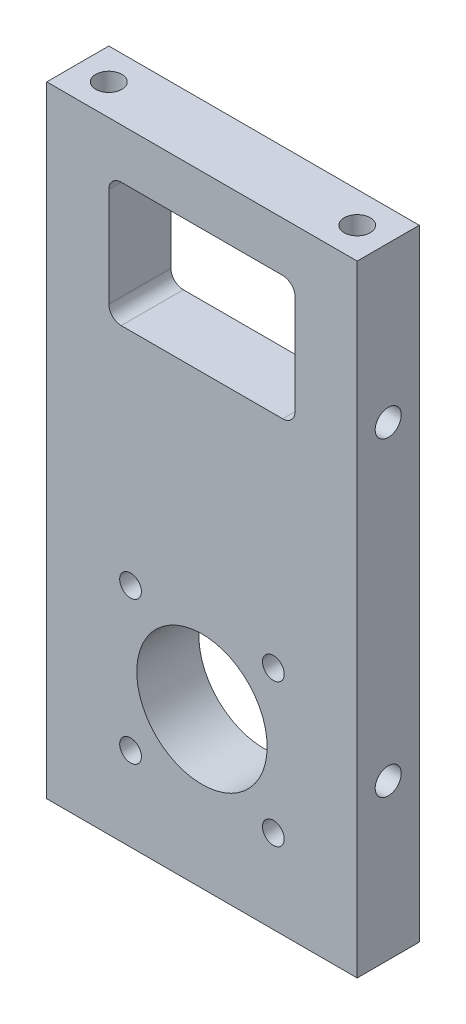
ISO-10303-21;
HEADER;
FILE_DESCRIPTION(('STEP AP214'),'2;1');
FILE_NAME('part.step','',(''),(''),'','','');
FILE_SCHEMA(('AUTOMOTIVE_DESIGN { 1 0 10303 214 1 1 1 1 }'));
ENDSEC;
DATA;
#1=APPLICATION_CONTEXT('core data for automotive mechanical design processes');
#2=APPLICATION_PROTOCOL_DEFINITION('international standard','automotive_design',2000,#1);
#3=PRODUCT_CONTEXT('',#1,'mechanical');
#4=PRODUCT('Part','Part','',(#3));
#5=PRODUCT_RELATED_PRODUCT_CATEGORY('part','',(#4));
#6=PRODUCT_DEFINITION_FORMATION('','',#4);
#7=PRODUCT_DEFINITION_CONTEXT('part definition',#1,'design');
#8=PRODUCT_DEFINITION('design','',#6,#7);
#9=PRODUCT_DEFINITION_SHAPE('','',#8);
#10=(LENGTH_UNIT() NAMED_UNIT(*) SI_UNIT(.MILLI.,.METRE.));
#11=(NAMED_UNIT(*) PLANE_ANGLE_UNIT() SI_UNIT($,.RADIAN.));
#12=(NAMED_UNIT(*) SI_UNIT($,.STERADIAN.) SOLID_ANGLE_UNIT());
#13=UNCERTAINTY_MEASURE_WITH_UNIT(LENGTH_MEASURE(1.E-05),#10,'distance_accuracy_value','');
#14=(GEOMETRIC_REPRESENTATION_CONTEXT(3) GLOBAL_UNCERTAINTY_ASSIGNED_CONTEXT((#13)) GLOBAL_UNIT_ASSIGNED_CONTEXT((#10,
#11,#12)) REPRESENTATION_CONTEXT('',''));
#15=CARTESIAN_POINT('',(0.,0.,0.));
#16=DIRECTION('',(0.,0.,1.));
#17=DIRECTION('',(1.,0.,0.));
#18=AXIS2_PLACEMENT_3D('',#15,#16,#17);
#19=CARTESIAN_POINT('',(-26.0517455341106,100.,394.692172038795));
#20=DIRECTION('',(1.,0.,0.));
#21=DIRECTION('',(0.,0.,-1.));
#22=AXIS2_PLACEMENT_3D('',#19,#20,#21);
#23=PLANE('',#22);
#24=CARTESIAN_POINT('',(-26.0517455341106,75.,389.692172038795));
#25=DIRECTION('',(-1.,0.,0.));
#26=DIRECTION('',(0.,0.,1.));
#27=AXIS2_PLACEMENT_3D('',#24,#25,#26);
#28=CIRCLE('',#27,2.09999999999999);
#29=CARTESIAN_POINT('',(-26.0517455341106,75.,391.792172038795));
#30=VERTEX_POINT('',#29);
#31=EDGE_CURVE('E171',#30,#30,#28,.T.);
#32=ORIENTED_EDGE('',*,*,#31,.F.);
#33=EDGE_LOOP('',(#32));
#34=FACE_BOUND('',#33,.T.);
#35=CARTESIAN_POINT('',(-26.0517455341106,25.,389.692172038795));
#36=DIRECTION('',(-1.,0.,0.));
#37=DIRECTION('',(0.,0.,1.));
#38=AXIS2_PLACEMENT_3D('',#35,#36,#37);
#39=CIRCLE('',#38,2.09999999999999);
#40=CARTESIAN_POINT('',(-26.0517455341106,25.,391.792172038795));
#41=VERTEX_POINT('',#40);
#42=EDGE_CURVE('E177',#41,#41,#39,.T.);
#43=ORIENTED_EDGE('',*,*,#42,.F.);
#44=EDGE_LOOP('',(#43));
#45=FACE_BOUND('',#44,.T.);
#46=DIRECTION('',(0.,0.,1.));
#47=VECTOR('',#46,1.);
#48=CARTESIAN_POINT('',(-26.0517455341106,0.,394.692172038795));
#49=LINE('',#48,#47);
#50=CARTESIAN_POINT('',(-26.0517455341106,0.,384.692172038795));
#51=VERTEX_POINT('',#50);
#52=CARTESIAN_POINT('',(-26.0517455341106,0.,394.692172038795));
#53=VERTEX_POINT('',#52);
#54=EDGE_CURVE('E207',#51,#53,#49,.T.);
#55=ORIENTED_EDGE('',*,*,#54,.T.);
#56=DIRECTION('',(0.,-1.,0.));
#57=VECTOR('',#56,1.);
#58=CARTESIAN_POINT('',(-26.0517455341106,100.,394.692172038795));
#59=LINE('',#58,#57);
#60=CARTESIAN_POINT('',(-26.0517455341106,100.,394.692172038795));
#61=VERTEX_POINT('',#60);
#62=EDGE_CURVE('E234',#61,#53,#59,.T.);
#63=ORIENTED_EDGE('',*,*,#62,.F.);
#64=DIRECTION('',(0.,0.,1.));
#65=VECTOR('',#64,1.);
#66=CARTESIAN_POINT('',(-26.0517455341106,100.,394.692172038795));
#67=LINE('',#66,#65);
#68=CARTESIAN_POINT('',(-26.0517455341106,100.,384.692172038795));
#69=VERTEX_POINT('',#68);
#70=EDGE_CURVE('E208',#69,#61,#67,.T.);
#71=ORIENTED_EDGE('',*,*,#70,.F.);
#72=DIRECTION('',(0.,-1.,0.));
#73=VECTOR('',#72,1.);
#74=CARTESIAN_POINT('',(-26.0517455341106,100.,384.692172038795));
#75=LINE('',#74,#73);
#76=EDGE_CURVE('E218',#69,#51,#75,.T.);
#77=ORIENTED_EDGE('',*,*,#76,.T.);
#78=EDGE_LOOP('',(#55,#63,#71,#77));
#79=FACE_BOUND('',#78,.T.);
#80=ADVANCED_FACE('F37',(#34,#45,#79),#23,.F.);
#81=CARTESIAN_POINT('',(-26.0517455341106,100.,394.692172038795));
#82=DIRECTION('',(0.,0.,-1.));
#83=DIRECTION('',(-1.,0.,0.));
#84=AXIS2_PLACEMENT_3D('',#81,#82,#83);
#85=PLANE('',#84);
#86=CARTESIAN_POINT('',(-12.5517455341106,13.5,394.692172038795));
#87=DIRECTION('',(0.,0.,1.));
#88=DIRECTION('',(1.,0.,0.));
#89=AXIS2_PLACEMENT_3D('',#86,#87,#88);
#90=CIRCLE('',#89,1.75);
#91=CARTESIAN_POINT('',(-10.8017455341106,13.5,394.692172038795));
#92=VERTEX_POINT('',#91);
#93=EDGE_CURVE('E730',#92,#92,#90,.T.);
#94=ORIENTED_EDGE('',*,*,#93,.F.);
#95=EDGE_LOOP('',(#94));
#96=FACE_BOUND('',#95,.T.);
#97=CARTESIAN_POINT('',(10.4482544658894,13.5,394.692172038795));
#98=DIRECTION('',(0.,0.,1.));
#99=DIRECTION('',(1.,0.,0.));
#100=AXIS2_PLACEMENT_3D('',#97,#98,#99);
#101=CIRCLE('',#100,1.75);
#102=CARTESIAN_POINT('',(12.1982544658894,13.5,394.692172038795));
#103=VERTEX_POINT('',#102);
#104=EDGE_CURVE('E724',#103,#103,#101,.T.);
#105=ORIENTED_EDGE('',*,*,#104,.F.);
#106=EDGE_LOOP('',(#105));
#107=FACE_BOUND('',#106,.T.);
#108=CARTESIAN_POINT('',(10.4482544658894,36.5,394.692172038795));
#109=DIRECTION('',(0.,0.,1.));
#110=DIRECTION('',(1.,0.,0.));
#111=AXIS2_PLACEMENT_3D('',#108,#109,#110);
#112=CIRCLE('',#111,1.75);
#113=CARTESIAN_POINT('',(12.1982544658894,36.5,394.692172038795));
#114=VERTEX_POINT('',#113);
#115=EDGE_CURVE('E718',#114,#114,#112,.T.);
#116=ORIENTED_EDGE('',*,*,#115,.F.);
#117=EDGE_LOOP('',(#116));
#118=FACE_BOUND('',#117,.T.);
#119=CARTESIAN_POINT('',(-12.5517455341106,36.5,394.692172038795));
#120=DIRECTION('',(0.,0.,1.));
#121=DIRECTION('',(1.,0.,0.));
#122=AXIS2_PLACEMENT_3D('',#119,#120,#121);
#123=CIRCLE('',#122,1.75);
#124=CARTESIAN_POINT('',(-10.8017455341106,36.5,394.692172038795));
#125=VERTEX_POINT('',#124);
#126=EDGE_CURVE('E710',#125,#125,#123,.T.);
#127=ORIENTED_EDGE('',*,*,#126,.F.);
#128=EDGE_LOOP('',(#127));
#129=FACE_BOUND('',#128,.T.);
#130=CARTESIAN_POINT('',(-1.05174553411058,25.,394.692172038795));
#131=DIRECTION('',(0.,0.,1.));
#132=DIRECTION('',(1.,0.,0.));
#133=AXIS2_PLACEMENT_3D('',#130,#131,#132);
#134=CIRCLE('',#133,10.5);
#135=CARTESIAN_POINT('',(9.44825446588942,25.,394.692172038795));
#136=VERTEX_POINT('',#135);
#137=EDGE_CURVE('E334',#136,#136,#134,.T.);
#138=ORIENTED_EDGE('',*,*,#137,.F.);
#139=EDGE_LOOP('',(#138));
#140=FACE_BOUND('',#139,.T.);
#141=DIRECTION('',(1.,0.,0.));
#142=VECTOR('',#141,1.);
#143=CARTESIAN_POINT('',(-16.0517455341106,72.,394.692172038795));
#144=LINE('',#143,#142);
#145=CARTESIAN_POINT('',(-14.0517455341106,72.,394.692172038795));
#146=VERTEX_POINT('',#145);
#147=CARTESIAN_POINT('',(11.9482544658894,72.,394.692172038795));
#148=VERTEX_POINT('',#147);
#149=EDGE_CURVE('E339',#146,#148,#144,.T.);
#150=ORIENTED_EDGE('',*,*,#149,.F.);
#151=CARTESIAN_POINT('',(-14.0517455341106,74.,394.692172038795));
#152=DIRECTION('',(0.,0.,-1.));
#153=DIRECTION('',(-1.,0.,0.));
#154=AXIS2_PLACEMENT_3D('',#151,#152,#153);
#155=CIRCLE('',#154,2.);
#156=CARTESIAN_POINT('',(-16.0517455341106,74.,394.692172038795));
#157=VERTEX_POINT('',#156);
#158=EDGE_CURVE('E45',#146,#157,#155,.T.);
#159=ORIENTED_EDGE('',*,*,#158,.T.);
#160=DIRECTION('',(0.,-1.,0.));
#161=VECTOR('',#160,1.);
#162=CARTESIAN_POINT('',(-16.0517455341106,92.,394.692172038795));
#163=LINE('',#162,#161);
#164=CARTESIAN_POINT('',(-16.0517455341106,90.,394.692172038795));
#165=VERTEX_POINT('',#164);
#166=EDGE_CURVE('E280',#165,#157,#163,.T.);
#167=ORIENTED_EDGE('',*,*,#166,.F.);
#168=CARTESIAN_POINT('',(-14.0517455341106,90.,394.692172038795));
#169=DIRECTION('',(0.,0.,-1.));
#170=DIRECTION('',(-1.,0.,0.));
#171=AXIS2_PLACEMENT_3D('',#168,#169,#170);
#172=CIRCLE('',#171,2.);
#173=CARTESIAN_POINT('',(-14.0517455341106,92.,394.692172038795));
#174=VERTEX_POINT('',#173);
#175=EDGE_CURVE('E59',#165,#174,#172,.T.);
#176=ORIENTED_EDGE('',*,*,#175,.T.);
#177=DIRECTION('',(-1.,0.,0.));
#178=VECTOR('',#177,1.);
#179=CARTESIAN_POINT('',(-16.0517455341106,92.,394.692172038795));
#180=LINE('',#179,#178);
#181=CARTESIAN_POINT('',(11.9482544658894,92.,394.692172038795));
#182=VERTEX_POINT('',#181);
#183=EDGE_CURVE('E344',#182,#174,#180,.T.);
#184=ORIENTED_EDGE('',*,*,#183,.F.);
#185=CARTESIAN_POINT('',(11.9482544658894,90.,394.692172038795));
#186=DIRECTION('',(0.,0.,-1.));
#187=DIRECTION('',(-1.,0.,0.));
#188=AXIS2_PLACEMENT_3D('',#185,#186,#187);
#189=CIRCLE('',#188,2.);
#190=CARTESIAN_POINT('',(13.9482544658894,90.,394.692172038795));
#191=VERTEX_POINT('',#190);
#192=EDGE_CURVE('E260',#182,#191,#189,.T.);
#193=ORIENTED_EDGE('',*,*,#192,.T.);
#194=DIRECTION('',(0.,1.,0.));
#195=VECTOR('',#194,1.);
#196=CARTESIAN_POINT('',(13.9482544658894,92.,394.692172038795));
#197=LINE('',#196,#195);
#198=CARTESIAN_POINT('',(13.9482544658894,74.,394.692172038795));
#199=VERTEX_POINT('',#198);
#200=EDGE_CURVE('E342',#199,#191,#197,.T.);
#201=ORIENTED_EDGE('',*,*,#200,.F.);
#202=CARTESIAN_POINT('',(11.9482544658894,74.,394.692172038795));
#203=DIRECTION('',(0.,0.,-1.));
#204=DIRECTION('',(-1.,0.,0.));
#205=AXIS2_PLACEMENT_3D('',#202,#203,#204);
#206=CIRCLE('',#205,2.);
#207=EDGE_CURVE('E256',#199,#148,#206,.T.);
#208=ORIENTED_EDGE('',*,*,#207,.T.);
#209=EDGE_LOOP('',(#150,#159,#167,#176,#184,#193,#201,#208));
#210=FACE_BOUND('',#209,.T.);
#211=DIRECTION('',(1.,0.,0.));
#212=VECTOR('',#211,1.);
#213=CARTESIAN_POINT('',(-26.0517455341106,0.,394.692172038795));
#214=LINE('',#213,#212);
#215=CARTESIAN_POINT('',(23.9482544658894,0.,394.692172038795));
#216=VERTEX_POINT('',#215);
#217=EDGE_CURVE('E221',#53,#216,#214,.T.);
#218=ORIENTED_EDGE('',*,*,#217,.T.);
#219=DIRECTION('',(0.,-1.,0.));
#220=VECTOR('',#219,1.);
#221=CARTESIAN_POINT('',(23.9482544658894,100.,394.692172038795));
#222=LINE('',#221,#220);
#223=CARTESIAN_POINT('',(23.9482544658894,100.,394.692172038795));
#224=VERTEX_POINT('',#223);
#225=EDGE_CURVE('E231',#224,#216,#222,.T.);
#226=ORIENTED_EDGE('',*,*,#225,.F.);
#227=DIRECTION('',(1.,0.,0.));
#228=VECTOR('',#227,1.);
#229=CARTESIAN_POINT('',(-26.0517455341106,100.,394.692172038795));
#230=LINE('',#229,#228);
#231=EDGE_CURVE('E211',#61,#224,#230,.T.);
#232=ORIENTED_EDGE('',*,*,#231,.F.);
#233=ORIENTED_EDGE('',*,*,#62,.T.);
#234=EDGE_LOOP('',(#218,#226,#232,#233));
#235=FACE_BOUND('',#234,.T.);
#236=ADVANCED_FACE('F294',(#96,#107,#118,#129,#140,#210,#235),#85,.F.);
#237=CARTESIAN_POINT('',(23.9482544658894,100.,394.692172038795));
#238=DIRECTION('',(-1.,0.,0.));
#239=DIRECTION('',(0.,0.,1.));
#240=AXIS2_PLACEMENT_3D('',#237,#238,#239);
#241=PLANE('',#240);
#242=CARTESIAN_POINT('',(23.9482544658894,75.,389.692172038795));
#243=DIRECTION('',(1.,0.,0.));
#244=DIRECTION('',(0.,0.,-1.));
#245=AXIS2_PLACEMENT_3D('',#242,#243,#244);
#246=CIRCLE('',#245,2.09999999999999);
#247=CARTESIAN_POINT('',(23.9482544658894,75.,387.592172038795));
#248=VERTEX_POINT('',#247);
#249=EDGE_CURVE('E159',#248,#248,#246,.T.);
#250=ORIENTED_EDGE('',*,*,#249,.F.);
#251=EDGE_LOOP('',(#250));
#252=FACE_BOUND('',#251,.T.);
#253=CARTESIAN_POINT('',(23.9482544658894,25.,389.692172038795));
#254=DIRECTION('',(1.,0.,0.));
#255=DIRECTION('',(0.,0.,-1.));
#256=AXIS2_PLACEMENT_3D('',#253,#254,#255);
#257=CIRCLE('',#256,2.09999999999999);
#258=CARTESIAN_POINT('',(23.9482544658894,25.,387.592172038795));
#259=VERTEX_POINT('',#258);
#260=EDGE_CURVE('E158',#259,#259,#257,.T.);
#261=ORIENTED_EDGE('',*,*,#260,.F.);
#262=EDGE_LOOP('',(#261));
#263=FACE_BOUND('',#262,.T.);
#264=DIRECTION('',(0.,0.,-1.));
#265=VECTOR('',#264,1.);
#266=CARTESIAN_POINT('',(23.9482544658894,0.,394.692172038795));
#267=LINE('',#266,#265);
#268=CARTESIAN_POINT('',(23.9482544658894,0.,384.692172038795));
#269=VERTEX_POINT('',#268);
#270=EDGE_CURVE('E223',#216,#269,#267,.T.);
#271=ORIENTED_EDGE('',*,*,#270,.T.);
#272=DIRECTION('',(0.,-1.,0.));
#273=VECTOR('',#272,1.);
#274=CARTESIAN_POINT('',(23.9482544658894,100.,384.692172038795));
#275=LINE('',#274,#273);
#276=CARTESIAN_POINT('',(23.9482544658894,100.,384.692172038795));
#277=VERTEX_POINT('',#276);
#278=EDGE_CURVE('E228',#277,#269,#275,.T.);
#279=ORIENTED_EDGE('',*,*,#278,.F.);
#280=DIRECTION('',(0.,0.,-1.));
#281=VECTOR('',#280,1.);
#282=CARTESIAN_POINT('',(23.9482544658894,100.,394.692172038795));
#283=LINE('',#282,#281);
#284=EDGE_CURVE('E214',#224,#277,#283,.T.);
#285=ORIENTED_EDGE('',*,*,#284,.F.);
#286=ORIENTED_EDGE('',*,*,#225,.T.);
#287=EDGE_LOOP('',(#271,#279,#285,#286));
#288=FACE_BOUND('',#287,.T.);
#289=ADVANCED_FACE('F300',(#252,#263,#288),#241,.F.);
#290=CARTESIAN_POINT('',(-26.0517455341106,100.,384.692172038795));
#291=DIRECTION('',(0.,0.,1.));
#292=DIRECTION('',(1.,0.,0.));
#293=AXIS2_PLACEMENT_3D('',#290,#291,#292);
#294=PLANE('',#293);
#295=CARTESIAN_POINT('',(-12.5517455341106,13.5,384.692172038795));
#296=DIRECTION('',(0.,0.,1.));
#297=DIRECTION('',(1.,0.,0.));
#298=AXIS2_PLACEMENT_3D('',#295,#296,#297);
#299=CIRCLE('',#298,1.75);
#300=CARTESIAN_POINT('',(-10.8017455341106,13.5,384.692172038795));
#301=VERTEX_POINT('',#300);
#302=EDGE_CURVE('E727',#301,#301,#299,.F.);
#303=ORIENTED_EDGE('',*,*,#302,.F.);
#304=EDGE_LOOP('',(#303));
#305=FACE_BOUND('',#304,.T.);
#306=CARTESIAN_POINT('',(10.4482544658894,13.5,384.692172038795));
#307=DIRECTION('',(0.,0.,1.));
#308=DIRECTION('',(1.,0.,0.));
#309=AXIS2_PLACEMENT_3D('',#306,#307,#308);
#310=CIRCLE('',#309,1.75);
#311=CARTESIAN_POINT('',(12.1982544658894,13.5,384.692172038795));
#312=VERTEX_POINT('',#311);
#313=EDGE_CURVE('E721',#312,#312,#310,.F.);
#314=ORIENTED_EDGE('',*,*,#313,.F.);
#315=EDGE_LOOP('',(#314));
#316=FACE_BOUND('',#315,.T.);
#317=CARTESIAN_POINT('',(10.4482544658894,36.5,384.692172038795));
#318=DIRECTION('',(0.,0.,1.));
#319=DIRECTION('',(1.,0.,0.));
#320=AXIS2_PLACEMENT_3D('',#317,#318,#319);
#321=CIRCLE('',#320,1.75);
#322=CARTESIAN_POINT('',(12.1982544658894,36.5,384.692172038795));
#323=VERTEX_POINT('',#322);
#324=EDGE_CURVE('E715',#323,#323,#321,.F.);
#325=ORIENTED_EDGE('',*,*,#324,.F.);
#326=EDGE_LOOP('',(#325));
#327=FACE_BOUND('',#326,.T.);
#328=CARTESIAN_POINT('',(-12.5517455341106,36.5,384.692172038795));
#329=DIRECTION('',(0.,0.,1.));
#330=DIRECTION('',(1.,0.,0.));
#331=AXIS2_PLACEMENT_3D('',#328,#329,#330);
#332=CIRCLE('',#331,1.75);
#333=CARTESIAN_POINT('',(-10.8017455341106,36.5,384.692172038795));
#334=VERTEX_POINT('',#333);
#335=EDGE_CURVE('E708',#334,#334,#332,.F.);
#336=ORIENTED_EDGE('',*,*,#335,.F.);
#337=EDGE_LOOP('',(#336));
#338=FACE_BOUND('',#337,.T.);
#339=CARTESIAN_POINT('',(-1.05174553411058,25.,384.692172038795));
#340=DIRECTION('',(0.,0.,1.));
#341=DIRECTION('',(1.,0.,0.));
#342=AXIS2_PLACEMENT_3D('',#339,#340,#341);
#343=CIRCLE('',#342,10.5);
#344=CARTESIAN_POINT('',(9.44825446588942,25.,384.692172038795));
#345=VERTEX_POINT('',#344);
#346=EDGE_CURVE('E330',#345,#345,#343,.F.);
#347=ORIENTED_EDGE('',*,*,#346,.F.);
#348=EDGE_LOOP('',(#347));
#349=FACE_BOUND('',#348,.T.);
#350=DIRECTION('',(1.,0.,0.));
#351=VECTOR('',#350,1.);
#352=CARTESIAN_POINT('',(-16.0517455341106,92.,384.692172038795));
#353=LINE('',#352,#351);
#354=CARTESIAN_POINT('',(-14.0517455341106,92.,384.692172038795));
#355=VERTEX_POINT('',#354);
#356=CARTESIAN_POINT('',(11.9482544658894,92.,384.692172038795));
#357=VERTEX_POINT('',#356);
#358=EDGE_CURVE('E276',#355,#357,#353,.T.);
#359=ORIENTED_EDGE('',*,*,#358,.F.);
#360=CARTESIAN_POINT('',(-14.0517455341106,90.,384.692172038795));
#361=DIRECTION('',(0.,0.,1.));
#362=DIRECTION('',(1.,0.,0.));
#363=AXIS2_PLACEMENT_3D('',#360,#361,#362);
#364=CIRCLE('',#363,2.);
#365=CARTESIAN_POINT('',(-16.0517455341106,90.,384.692172038795));
#366=VERTEX_POINT('',#365);
#367=EDGE_CURVE('E265',#355,#366,#364,.T.);
#368=ORIENTED_EDGE('',*,*,#367,.T.);
#369=DIRECTION('',(0.,1.,0.));
#370=VECTOR('',#369,1.);
#371=CARTESIAN_POINT('',(-16.0517455341106,92.,384.692172038795));
#372=LINE('',#371,#370);
#373=CARTESIAN_POINT('',(-16.0517455341106,74.,384.692172038795));
#374=VERTEX_POINT('',#373);
#375=EDGE_CURVE('E273',#374,#366,#372,.T.);
#376=ORIENTED_EDGE('',*,*,#375,.F.);
#377=CARTESIAN_POINT('',(-14.0517455341106,74.,384.692172038795));
#378=DIRECTION('',(0.,0.,1.));
#379=DIRECTION('',(1.,0.,0.));
#380=AXIS2_PLACEMENT_3D('',#377,#378,#379);
#381=CIRCLE('',#380,2.);
#382=CARTESIAN_POINT('',(-14.0517455341106,72.,384.692172038795));
#383=VERTEX_POINT('',#382);
#384=EDGE_CURVE('E11',#374,#383,#381,.T.);
#385=ORIENTED_EDGE('',*,*,#384,.T.);
#386=DIRECTION('',(-1.,0.,0.));
#387=VECTOR('',#386,1.);
#388=CARTESIAN_POINT('',(-16.0517455341106,72.,384.692172038795));
#389=LINE('',#388,#387);
#390=CARTESIAN_POINT('',(11.9482544658894,72.,384.692172038795));
#391=VERTEX_POINT('',#390);
#392=EDGE_CURVE('E165',#391,#383,#389,.T.);
#393=ORIENTED_EDGE('',*,*,#392,.F.);
#394=CARTESIAN_POINT('',(11.9482544658894,74.,384.692172038795));
#395=DIRECTION('',(0.,0.,1.));
#396=DIRECTION('',(1.,0.,0.));
#397=AXIS2_PLACEMENT_3D('',#394,#395,#396);
#398=CIRCLE('',#397,2.);
#399=CARTESIAN_POINT('',(13.9482544658894,74.,384.692172038795));
#400=VERTEX_POINT('',#399);
#401=EDGE_CURVE('E258',#391,#400,#398,.T.);
#402=ORIENTED_EDGE('',*,*,#401,.T.);
#403=DIRECTION('',(0.,-1.,0.));
#404=VECTOR('',#403,1.);
#405=CARTESIAN_POINT('',(13.9482544658894,92.,384.692172038795));
#406=LINE('',#405,#404);
#407=CARTESIAN_POINT('',(13.9482544658894,90.,384.692172038795));
#408=VERTEX_POINT('',#407);
#409=EDGE_CURVE('E322',#408,#400,#406,.T.);
#410=ORIENTED_EDGE('',*,*,#409,.F.);
#411=CARTESIAN_POINT('',(11.9482544658894,90.,384.692172038795));
#412=DIRECTION('',(0.,0.,1.));
#413=DIRECTION('',(1.,0.,0.));
#414=AXIS2_PLACEMENT_3D('',#411,#412,#413);
#415=CIRCLE('',#414,2.);
#416=EDGE_CURVE('E262',#408,#357,#415,.T.);
#417=ORIENTED_EDGE('',*,*,#416,.T.);
#418=EDGE_LOOP('',(#359,#368,#376,#385,#393,#402,#410,#417));
#419=FACE_BOUND('',#418,.T.);
#420=DIRECTION('',(-1.,0.,0.));
#421=VECTOR('',#420,1.);
#422=CARTESIAN_POINT('',(-26.0517455341106,0.,384.692172038795));
#423=LINE('',#422,#421);
#424=EDGE_CURVE('E212',#269,#51,#423,.T.);
#425=ORIENTED_EDGE('',*,*,#424,.T.);
#426=ORIENTED_EDGE('',*,*,#76,.F.);
#427=DIRECTION('',(-1.,0.,0.));
#428=VECTOR('',#427,1.);
#429=CARTESIAN_POINT('',(-26.0517455341106,100.,384.692172038795));
#430=LINE('',#429,#428);
#431=EDGE_CURVE('E216',#277,#69,#430,.T.);
#432=ORIENTED_EDGE('',*,*,#431,.F.);
#433=ORIENTED_EDGE('',*,*,#278,.T.);
#434=EDGE_LOOP('',(#425,#426,#432,#433));
#435=FACE_BOUND('',#434,.T.);
#436=ADVANCED_FACE('F271',(#305,#316,#327,#338,#349,#419,#435),#294,.F.);
#437=CARTESIAN_POINT('',(-26.0517455341106,100.,384.692172038795));
#438=DIRECTION('',(0.,-1.,0.));
#439=DIRECTION('',(0.,0.,-1.));
#440=AXIS2_PLACEMENT_3D('',#437,#438,#439);
#441=PLANE('',#440);
#442=CARTESIAN_POINT('',(-21.0517455341106,100.,389.692172038795));
#443=DIRECTION('',(0.,1.,0.));
#444=DIRECTION('',(0.,0.,1.));
#445=AXIS2_PLACEMENT_3D('',#442,#443,#444);
#446=CIRCLE('',#445,2.09999999999999);
#447=CARTESIAN_POINT('',(-21.0517455341106,100.,391.792172038795));
#448=VERTEX_POINT('',#447);
#449=EDGE_CURVE('E183',#448,#448,#446,.T.);
#450=ORIENTED_EDGE('',*,*,#449,.F.);
#451=EDGE_LOOP('',(#450));
#452=FACE_BOUND('',#451,.T.);
#453=CARTESIAN_POINT('',(18.9482544658894,100.,389.692172038795));
#454=DIRECTION('',(0.,1.,0.));
#455=DIRECTION('',(0.,0.,1.));
#456=AXIS2_PLACEMENT_3D('',#453,#454,#455);
#457=CIRCLE('',#456,2.09999999999999);
#458=CARTESIAN_POINT('',(18.9482544658894,100.,391.792172038795));
#459=VERTEX_POINT('',#458);
#460=EDGE_CURVE('E189',#459,#459,#457,.T.);
#461=ORIENTED_EDGE('',*,*,#460,.F.);
#462=EDGE_LOOP('',(#461));
#463=FACE_BOUND('',#462,.T.);
#464=ORIENTED_EDGE('',*,*,#70,.T.);
#465=ORIENTED_EDGE('',*,*,#231,.T.);
#466=ORIENTED_EDGE('',*,*,#284,.T.);
#467=ORIENTED_EDGE('',*,*,#431,.T.);
#468=EDGE_LOOP('',(#464,#465,#466,#467));
#469=FACE_BOUND('',#468,.T.);
#470=ADVANCED_FACE('F426',(#452,#463,#469),#441,.F.);
#471=CARTESIAN_POINT('',(-26.0517455341106,0.,384.692172038795));
#472=DIRECTION('',(0.,-1.,0.));
#473=DIRECTION('',(0.,0.,-1.));
#474=AXIS2_PLACEMENT_3D('',#471,#472,#473);
#475=PLANE('',#474);
#476=CARTESIAN_POINT('',(18.9482544658894,0.,389.692172038795));
#477=DIRECTION('',(0.,-1.,0.));
#478=DIRECTION('',(0.,0.,-1.));
#479=AXIS2_PLACEMENT_3D('',#476,#477,#478);
#480=CIRCLE('',#479,2.09999999999999);
#481=CARTESIAN_POINT('',(18.9482544658894,0.,387.592172038795));
#482=VERTEX_POINT('',#481);
#483=EDGE_CURVE('E195',#482,#482,#480,.T.);
#484=ORIENTED_EDGE('',*,*,#483,.F.);
#485=EDGE_LOOP('',(#484));
#486=FACE_BOUND('',#485,.T.);
#487=CARTESIAN_POINT('',(-21.0517455341106,0.,389.692172038795));
#488=DIRECTION('',(0.,-1.,0.));
#489=DIRECTION('',(0.,0.,-1.));
#490=AXIS2_PLACEMENT_3D('',#487,#488,#489);
#491=CIRCLE('',#490,2.09999999999999);
#492=CARTESIAN_POINT('',(-21.0517455341106,0.,387.592172038795));
#493=VERTEX_POINT('',#492);
#494=EDGE_CURVE('E201',#493,#493,#491,.T.);
#495=ORIENTED_EDGE('',*,*,#494,.F.);
#496=EDGE_LOOP('',(#495));
#497=FACE_BOUND('',#496,.T.);
#498=ORIENTED_EDGE('',*,*,#54,.F.);
#499=ORIENTED_EDGE('',*,*,#424,.F.);
#500=ORIENTED_EDGE('',*,*,#270,.F.);
#501=ORIENTED_EDGE('',*,*,#217,.F.);
#502=EDGE_LOOP('',(#498,#499,#500,#501));
#503=FACE_BOUND('',#502,.T.);
#504=ADVANCED_FACE('F424',(#486,#497,#503),#475,.T.);
#505=CARTESIAN_POINT('',(-21.0517455341106,14.,389.692172038795));
#506=DIRECTION('',(0.,-1.,0.));
#507=DIRECTION('',(0.,0.,-1.));
#508=AXIS2_PLACEMENT_3D('',#505,#506,#507);
#509=CONICAL_SURFACE('',#508,2.1,1.02974425867665);
#510=CARTESIAN_POINT('',(-21.0517455341106,15.2618072999579,389.692172038795));
#511=VERTEX_POINT('',#510);
#512=VERTEX_LOOP('',#511);
#513=FACE_BOUND('',#512,.T.);
#514=CARTESIAN_POINT('',(-21.0517455341106,14.,389.692172038795));
#515=DIRECTION('',(0.,-1.,0.));
#516=DIRECTION('',(0.,0.,-1.));
#517=AXIS2_PLACEMENT_3D('',#514,#515,#516);
#518=CIRCLE('',#517,2.1);
#519=CARTESIAN_POINT('',(-21.0517455341106,14.,387.592172038795));
#520=VERTEX_POINT('',#519);
#521=EDGE_CURVE('E204',#520,#520,#518,.T.);
#522=ORIENTED_EDGE('',*,*,#521,.T.);
#523=EDGE_LOOP('',(#522));
#524=FACE_BOUND('',#523,.T.);
#525=ADVANCED_FACE('F420',(#513,#524),#509,.F.);
#526=CARTESIAN_POINT('',(-21.0517455341106,0.,389.692172038795));
#527=DIRECTION('',(0.,-1.,0.));
#528=DIRECTION('',(0.,0.,-1.));
#529=AXIS2_PLACEMENT_3D('',#526,#527,#528);
#530=CYLINDRICAL_SURFACE('',#529,2.09999999999999);
#531=ORIENTED_EDGE('',*,*,#521,.F.);
#532=EDGE_LOOP('',(#531));
#533=FACE_BOUND('',#532,.T.);
#534=ORIENTED_EDGE('',*,*,#494,.T.);
#535=EDGE_LOOP('',(#534));
#536=FACE_BOUND('',#535,.T.);
#537=ADVANCED_FACE('F416',(#533,#536),#530,.F.);
#538=CARTESIAN_POINT('',(18.9482544658894,14.,389.692172038795));
#539=DIRECTION('',(0.,-1.,0.));
#540=DIRECTION('',(0.,0.,-1.));
#541=AXIS2_PLACEMENT_3D('',#538,#539,#540);
#542=CONICAL_SURFACE('',#541,2.1,1.02974425867665);
#543=CARTESIAN_POINT('',(18.9482544658894,15.2618072999579,389.692172038795));
#544=VERTEX_POINT('',#543);
#545=VERTEX_LOOP('',#544);
#546=FACE_BOUND('',#545,.T.);
#547=CARTESIAN_POINT('',(18.9482544658894,14.,389.692172038795));
#548=DIRECTION('',(0.,-1.,0.));
#549=DIRECTION('',(0.,0.,-1.));
#550=AXIS2_PLACEMENT_3D('',#547,#548,#549);
#551=CIRCLE('',#550,2.1);
#552=CARTESIAN_POINT('',(18.9482544658894,14.,387.592172038795));
#553=VERTEX_POINT('',#552);
#554=EDGE_CURVE('E198',#553,#553,#551,.T.);
#555=ORIENTED_EDGE('',*,*,#554,.T.);
#556=EDGE_LOOP('',(#555));
#557=FACE_BOUND('',#556,.T.);
#558=ADVANCED_FACE('F412',(#546,#557),#542,.F.);
#559=CARTESIAN_POINT('',(18.9482544658894,0.,389.692172038795));
#560=DIRECTION('',(0.,-1.,0.));
#561=DIRECTION('',(0.,0.,-1.));
#562=AXIS2_PLACEMENT_3D('',#559,#560,#561);
#563=CYLINDRICAL_SURFACE('',#562,2.09999999999999);
#564=ORIENTED_EDGE('',*,*,#554,.F.);
#565=EDGE_LOOP('',(#564));
#566=FACE_BOUND('',#565,.T.);
#567=ORIENTED_EDGE('',*,*,#483,.T.);
#568=EDGE_LOOP('',(#567));
#569=FACE_BOUND('',#568,.T.);
#570=ADVANCED_FACE('F408',(#566,#569),#563,.F.);
#571=CARTESIAN_POINT('',(18.9482544658894,86.,389.692172038795));
#572=DIRECTION('',(0.,1.,0.));
#573=DIRECTION('',(0.,0.,1.));
#574=AXIS2_PLACEMENT_3D('',#571,#572,#573);
#575=CONICAL_SURFACE('',#574,2.09999999999999,1.02974425867665);
#576=CARTESIAN_POINT('',(18.9482544658894,84.7381927000421,389.692172038795));
#577=VERTEX_POINT('',#576);
#578=VERTEX_LOOP('',#577);
#579=FACE_BOUND('',#578,.T.);
#580=CARTESIAN_POINT('',(18.9482544658894,86.,389.692172038795));
#581=DIRECTION('',(0.,1.,0.));
#582=DIRECTION('',(0.,0.,1.));
#583=AXIS2_PLACEMENT_3D('',#580,#581,#582);
#584=CIRCLE('',#583,2.09999999999999);
#585=CARTESIAN_POINT('',(18.9482544658894,86.,391.792172038795));
#586=VERTEX_POINT('',#585);
#587=EDGE_CURVE('E192',#586,#586,#584,.T.);
#588=ORIENTED_EDGE('',*,*,#587,.T.);
#589=EDGE_LOOP('',(#588));
#590=FACE_BOUND('',#589,.T.);
#591=ADVANCED_FACE('F404',(#579,#590),#575,.F.);
#592=CARTESIAN_POINT('',(18.9482544658894,100.,389.692172038795));
#593=DIRECTION('',(0.,1.,0.));
#594=DIRECTION('',(0.,0.,1.));
#595=AXIS2_PLACEMENT_3D('',#592,#593,#594);
#596=CYLINDRICAL_SURFACE('',#595,2.09999999999999);
#597=ORIENTED_EDGE('',*,*,#587,.F.);
#598=EDGE_LOOP('',(#597));
#599=FACE_BOUND('',#598,.T.);
#600=ORIENTED_EDGE('',*,*,#460,.T.);
#601=EDGE_LOOP('',(#600));
#602=FACE_BOUND('',#601,.T.);
#603=ADVANCED_FACE('F400',(#599,#602),#596,.F.);
#604=CARTESIAN_POINT('',(-21.0517455341106,86.,389.692172038795));
#605=DIRECTION('',(0.,1.,0.));
#606=DIRECTION('',(0.,0.,1.));
#607=AXIS2_PLACEMENT_3D('',#604,#605,#606);
#608=CONICAL_SURFACE('',#607,2.09999999999999,1.02974425867665);
#609=CARTESIAN_POINT('',(-21.0517455341106,84.7381927000421,389.692172038795));
#610=VERTEX_POINT('',#609);
#611=VERTEX_LOOP('',#610);
#612=FACE_BOUND('',#611,.T.);
#613=CARTESIAN_POINT('',(-21.0517455341106,86.,389.692172038795));
#614=DIRECTION('',(0.,1.,0.));
#615=DIRECTION('',(0.,0.,1.));
#616=AXIS2_PLACEMENT_3D('',#613,#614,#615);
#617=CIRCLE('',#616,2.09999999999999);
#618=CARTESIAN_POINT('',(-21.0517455341106,86.,391.792172038795));
#619=VERTEX_POINT('',#618);
#620=EDGE_CURVE('E186',#619,#619,#617,.T.);
#621=ORIENTED_EDGE('',*,*,#620,.T.);
#622=EDGE_LOOP('',(#621));
#623=FACE_BOUND('',#622,.T.);
#624=ADVANCED_FACE('F396',(#612,#623),#608,.F.);
#625=CARTESIAN_POINT('',(-21.0517455341106,100.,389.692172038795));
#626=DIRECTION('',(0.,1.,0.));
#627=DIRECTION('',(0.,0.,1.));
#628=AXIS2_PLACEMENT_3D('',#625,#626,#627);
#629=CYLINDRICAL_SURFACE('',#628,2.09999999999999);
#630=ORIENTED_EDGE('',*,*,#620,.F.);
#631=EDGE_LOOP('',(#630));
#632=FACE_BOUND('',#631,.T.);
#633=ORIENTED_EDGE('',*,*,#449,.T.);
#634=EDGE_LOOP('',(#633));
#635=FACE_BOUND('',#634,.T.);
#636=ADVANCED_FACE('F392',(#632,#635),#629,.F.);
#637=CARTESIAN_POINT('',(-18.0517455341106,25.,389.692172038795));
#638=DIRECTION('',(-1.,0.,0.));
#639=DIRECTION('',(0.,0.,1.));
#640=AXIS2_PLACEMENT_3D('',#637,#638,#639);
#641=CONICAL_SURFACE('',#640,2.1,1.02974425867665);
#642=CARTESIAN_POINT('',(-16.7899382341527,25.,389.692172038795));
#643=VERTEX_POINT('',#642);
#644=VERTEX_LOOP('',#643);
#645=FACE_BOUND('',#644,.T.);
#646=CARTESIAN_POINT('',(-18.0517455341106,25.,389.692172038795));
#647=DIRECTION('',(-1.,0.,0.));
#648=DIRECTION('',(0.,0.,1.));
#649=AXIS2_PLACEMENT_3D('',#646,#647,#648);
#650=CIRCLE('',#649,2.1);
#651=CARTESIAN_POINT('',(-18.0517455341106,25.,391.792172038795));
#652=VERTEX_POINT('',#651);
#653=EDGE_CURVE('E180',#652,#652,#650,.T.);
#654=ORIENTED_EDGE('',*,*,#653,.T.);
#655=EDGE_LOOP('',(#654));
#656=FACE_BOUND('',#655,.T.);
#657=ADVANCED_FACE('F388',(#645,#656),#641,.F.);
#658=CARTESIAN_POINT('',(-26.0517455341106,25.,389.692172038795));
#659=DIRECTION('',(-1.,0.,0.));
#660=DIRECTION('',(0.,0.,1.));
#661=AXIS2_PLACEMENT_3D('',#658,#659,#660);
#662=CYLINDRICAL_SURFACE('',#661,2.09999999999999);
#663=ORIENTED_EDGE('',*,*,#653,.F.);
#664=EDGE_LOOP('',(#663));
#665=FACE_BOUND('',#664,.T.);
#666=ORIENTED_EDGE('',*,*,#42,.T.);
#667=EDGE_LOOP('',(#666));
#668=FACE_BOUND('',#667,.T.);
#669=ADVANCED_FACE('F384',(#665,#668),#662,.F.);
#670=CARTESIAN_POINT('',(-18.0517455341106,75.,389.692172038795));
#671=DIRECTION('',(-1.,0.,0.));
#672=DIRECTION('',(0.,0.,1.));
#673=AXIS2_PLACEMENT_3D('',#670,#671,#672);
#674=CONICAL_SURFACE('',#673,2.1,1.02974425867666);
#675=CARTESIAN_POINT('',(-16.7899382341527,75.,389.692172038795));
#676=VERTEX_POINT('',#675);
#677=VERTEX_LOOP('',#676);
#678=FACE_BOUND('',#677,.T.);
#679=CARTESIAN_POINT('',(-18.0517455341106,75.,389.692172038795));
#680=DIRECTION('',(-1.,0.,0.));
#681=DIRECTION('',(0.,0.,1.));
#682=AXIS2_PLACEMENT_3D('',#679,#680,#681);
#683=CIRCLE('',#682,2.1);
#684=CARTESIAN_POINT('',(-18.0517455341106,75.,391.792172038795));
#685=VERTEX_POINT('',#684);
#686=EDGE_CURVE('E174',#685,#685,#683,.T.);
#687=ORIENTED_EDGE('',*,*,#686,.T.);
#688=EDGE_LOOP('',(#687));
#689=FACE_BOUND('',#688,.T.);
#690=ADVANCED_FACE('F380',(#678,#689),#674,.F.);
#691=CARTESIAN_POINT('',(-26.0517455341106,75.,389.692172038795));
#692=DIRECTION('',(-1.,0.,0.));
#693=DIRECTION('',(0.,0.,1.));
#694=AXIS2_PLACEMENT_3D('',#691,#692,#693);
#695=CYLINDRICAL_SURFACE('',#694,2.1);
#696=ORIENTED_EDGE('',*,*,#686,.F.);
#697=EDGE_LOOP('',(#696));
#698=FACE_BOUND('',#697,.T.);
#699=ORIENTED_EDGE('',*,*,#31,.T.);
#700=EDGE_LOOP('',(#699));
#701=FACE_BOUND('',#700,.T.);
#702=ADVANCED_FACE('F376',(#698,#701),#695,.F.);
#703=CARTESIAN_POINT('',(15.9482544658894,25.,389.692172038795));
#704=DIRECTION('',(1.,0.,0.));
#705=DIRECTION('',(0.,0.,-1.));
#706=AXIS2_PLACEMENT_3D('',#703,#704,#705);
#707=CONICAL_SURFACE('',#706,2.1,1.02974425867665);
#708=CARTESIAN_POINT('',(14.6864471659315,25.,389.692172038795));
#709=VERTEX_POINT('',#708);
#710=VERTEX_LOOP('',#709);
#711=FACE_BOUND('',#710,.T.);
#712=CARTESIAN_POINT('',(15.9482544658894,25.,389.692172038795));
#713=DIRECTION('',(1.,0.,0.));
#714=DIRECTION('',(0.,0.,-1.));
#715=AXIS2_PLACEMENT_3D('',#712,#713,#714);
#716=CIRCLE('',#715,2.1);
#717=CARTESIAN_POINT('',(15.9482544658894,25.,387.592172038795));
#718=VERTEX_POINT('',#717);
#719=EDGE_CURVE('E162',#718,#718,#716,.T.);
#720=ORIENTED_EDGE('',*,*,#719,.T.);
#721=EDGE_LOOP('',(#720));
#722=FACE_BOUND('',#721,.T.);
#723=ADVANCED_FACE('F372',(#711,#722),#707,.F.);
#724=CARTESIAN_POINT('',(23.9482544658894,25.,389.692172038795));
#725=DIRECTION('',(1.,0.,0.));
#726=DIRECTION('',(0.,0.,-1.));
#727=AXIS2_PLACEMENT_3D('',#724,#725,#726);
#728=CYLINDRICAL_SURFACE('',#727,2.09999999999999);
#729=ORIENTED_EDGE('',*,*,#719,.F.);
#730=EDGE_LOOP('',(#729));
#731=FACE_BOUND('',#730,.T.);
#732=ORIENTED_EDGE('',*,*,#260,.T.);
#733=EDGE_LOOP('',(#732));
#734=FACE_BOUND('',#733,.T.);
#735=ADVANCED_FACE('F152',(#731,#734),#728,.F.);
#736=CARTESIAN_POINT('',(15.9482544658894,75.,389.692172038795));
#737=DIRECTION('',(1.,0.,0.));
#738=DIRECTION('',(0.,0.,-1.));
#739=AXIS2_PLACEMENT_3D('',#736,#737,#738);
#740=CONICAL_SURFACE('',#739,2.1,1.02974425867666);
#741=CARTESIAN_POINT('',(14.6864471659315,75.,389.692172038795));
#742=VERTEX_POINT('',#741);
#743=VERTEX_LOOP('',#742);
#744=FACE_BOUND('',#743,.T.);
#745=CARTESIAN_POINT('',(15.9482544658894,75.,389.692172038795));
#746=DIRECTION('',(1.,0.,0.));
#747=DIRECTION('',(0.,0.,-1.));
#748=AXIS2_PLACEMENT_3D('',#745,#746,#747);
#749=CIRCLE('',#748,2.1);
#750=CARTESIAN_POINT('',(15.9482544658894,75.,387.592172038795));
#751=VERTEX_POINT('',#750);
#752=EDGE_CURVE('E156',#751,#751,#749,.T.);
#753=ORIENTED_EDGE('',*,*,#752,.T.);
#754=EDGE_LOOP('',(#753));
#755=FACE_BOUND('',#754,.T.);
#756=ADVANCED_FACE('F148',(#744,#755),#740,.F.);
#757=CARTESIAN_POINT('',(23.9482544658894,75.,389.692172038795));
#758=DIRECTION('',(1.,0.,0.));
#759=DIRECTION('',(0.,0.,-1.));
#760=AXIS2_PLACEMENT_3D('',#757,#758,#759);
#761=CYLINDRICAL_SURFACE('',#760,2.1);
#762=ORIENTED_EDGE('',*,*,#752,.F.);
#763=EDGE_LOOP('',(#762));
#764=FACE_BOUND('',#763,.T.);
#765=ORIENTED_EDGE('',*,*,#249,.T.);
#766=EDGE_LOOP('',(#765));
#767=FACE_BOUND('',#766,.T.);
#768=ADVANCED_FACE('F151',(#764,#767),#761,.F.);
#769=CARTESIAN_POINT('',(-16.0517455341106,92.,384.691172038795));
#770=DIRECTION('',(-1.,0.,0.));
#771=DIRECTION('',(0.,-1.,0.));
#772=AXIS2_PLACEMENT_3D('',#769,#770,#771);
#773=PLANE('',#772);
#774=ORIENTED_EDGE('',*,*,#375,.T.);
#775=DIRECTION('',(0.,0.,1.));
#776=VECTOR('',#775,1.);
#777=CARTESIAN_POINT('',(-16.0517455341106,90.,394.692172038795));
#778=LINE('',#777,#776);
#779=EDGE_CURVE('E254',#366,#165,#778,.T.);
#780=ORIENTED_EDGE('',*,*,#779,.T.);
#781=ORIENTED_EDGE('',*,*,#166,.T.);
#782=DIRECTION('',(0.,0.,1.));
#783=VECTOR('',#782,1.);
#784=CARTESIAN_POINT('',(-16.0517455341106,74.,384.692172038795));
#785=LINE('',#784,#783);
#786=EDGE_CURVE('E252',#157,#374,#785,.F.);
#787=ORIENTED_EDGE('',*,*,#786,.T.);
#788=EDGE_LOOP('',(#774,#780,#781,#787));
#789=FACE_BOUND('',#788,.T.);
#790=ADVANCED_FACE('F278',(#789),#773,.F.);
#791=CARTESIAN_POINT('',(-16.0517455341106,92.,384.691172038795));
#792=DIRECTION('',(0.,1.,0.));
#793=DIRECTION('',(0.,0.,1.));
#794=AXIS2_PLACEMENT_3D('',#791,#792,#793);
#795=PLANE('',#794);
#796=ORIENTED_EDGE('',*,*,#358,.T.);
#797=DIRECTION('',(0.,0.,1.));
#798=VECTOR('',#797,1.);
#799=CARTESIAN_POINT('',(11.9482544658894,92.,394.692172038795));
#800=LINE('',#799,#798);
#801=EDGE_CURVE('E249',#357,#182,#800,.T.);
#802=ORIENTED_EDGE('',*,*,#801,.T.);
#803=ORIENTED_EDGE('',*,*,#183,.T.);
#804=DIRECTION('',(0.,0.,1.));
#805=VECTOR('',#804,1.);
#806=CARTESIAN_POINT('',(-14.0517455341106,92.,384.692172038795));
#807=LINE('',#806,#805);
#808=EDGE_CURVE('E247',#174,#355,#807,.F.);
#809=ORIENTED_EDGE('',*,*,#808,.T.);
#810=EDGE_LOOP('',(#796,#802,#803,#809));
#811=FACE_BOUND('',#810,.T.);
#812=ADVANCED_FACE('F353',(#811),#795,.F.);
#813=CARTESIAN_POINT('',(13.9482544658894,92.,384.691172038795));
#814=DIRECTION('',(1.,0.,0.));
#815=DIRECTION('',(0.,1.,0.));
#816=AXIS2_PLACEMENT_3D('',#813,#814,#815);
#817=PLANE('',#816);
#818=ORIENTED_EDGE('',*,*,#409,.T.);
#819=DIRECTION('',(0.,0.,1.));
#820=VECTOR('',#819,1.);
#821=CARTESIAN_POINT('',(13.9482544658894,74.,394.692172038795));
#822=LINE('',#821,#820);
#823=EDGE_CURVE('E239',#400,#199,#822,.T.);
#824=ORIENTED_EDGE('',*,*,#823,.T.);
#825=ORIENTED_EDGE('',*,*,#200,.T.);
#826=DIRECTION('',(0.,0.,1.));
#827=VECTOR('',#826,1.);
#828=CARTESIAN_POINT('',(13.9482544658894,90.,384.692172038795));
#829=LINE('',#828,#827);
#830=EDGE_CURVE('E237',#191,#408,#829,.F.);
#831=ORIENTED_EDGE('',*,*,#830,.T.);
#832=EDGE_LOOP('',(#818,#824,#825,#831));
#833=FACE_BOUND('',#832,.T.);
#834=ADVANCED_FACE('F326',(#833),#817,.F.);
#835=CARTESIAN_POINT('',(-16.0517455341106,72.,384.691172038795));
#836=DIRECTION('',(0.,-1.,0.));
#837=DIRECTION('',(0.,0.,-1.));
#838=AXIS2_PLACEMENT_3D('',#835,#836,#837);
#839=PLANE('',#838);
#840=ORIENTED_EDGE('',*,*,#149,.T.);
#841=DIRECTION('',(0.,0.,1.));
#842=VECTOR('',#841,1.);
#843=CARTESIAN_POINT('',(11.9482544658894,72.,384.692172038795));
#844=LINE('',#843,#842);
#845=EDGE_CURVE('E245',#148,#391,#844,.F.);
#846=ORIENTED_EDGE('',*,*,#845,.T.);
#847=ORIENTED_EDGE('',*,*,#392,.T.);
#848=DIRECTION('',(0.,0.,1.));
#849=VECTOR('',#848,1.);
#850=CARTESIAN_POINT('',(-14.0517455341106,72.,394.692172038795));
#851=LINE('',#850,#849);
#852=EDGE_CURVE('E242',#383,#146,#851,.T.);
#853=ORIENTED_EDGE('',*,*,#852,.T.);
#854=EDGE_LOOP('',(#840,#846,#847,#853));
#855=FACE_BOUND('',#854,.T.);
#856=ADVANCED_FACE('F348',(#855),#839,.F.);
#857=CARTESIAN_POINT('',(-1.05174553411058,25.,384.691172038795));
#858=DIRECTION('',(0.,0.,1.));
#859=DIRECTION('',(1.,0.,0.));
#860=AXIS2_PLACEMENT_3D('',#857,#858,#859);
#861=CYLINDRICAL_SURFACE('',#860,10.5);
#862=ORIENTED_EDGE('',*,*,#137,.T.);
#863=EDGE_LOOP('',(#862));
#864=FACE_BOUND('',#863,.T.);
#865=ORIENTED_EDGE('',*,*,#346,.T.);
#866=EDGE_LOOP('',(#865));
#867=FACE_BOUND('',#866,.T.);
#868=ADVANCED_FACE('F363',(#864,#867),#861,.F.);
#869=CARTESIAN_POINT('',(-12.5517455341106,36.5,384.691172038795));
#870=DIRECTION('',(0.,0.,1.));
#871=DIRECTION('',(1.,0.,0.));
#872=AXIS2_PLACEMENT_3D('',#869,#870,#871);
#873=CYLINDRICAL_SURFACE('',#872,1.75);
#874=ORIENTED_EDGE('',*,*,#126,.T.);
#875=EDGE_LOOP('',(#874));
#876=FACE_BOUND('',#875,.T.);
#877=ORIENTED_EDGE('',*,*,#335,.T.);
#878=EDGE_LOOP('',(#877));
#879=FACE_BOUND('',#878,.T.);
#880=ADVANCED_FACE('F611',(#876,#879),#873,.F.);
#881=CARTESIAN_POINT('',(10.4482544658894,36.5,384.691172038795));
#882=DIRECTION('',(0.,0.,1.));
#883=DIRECTION('',(1.,0.,0.));
#884=AXIS2_PLACEMENT_3D('',#881,#882,#883);
#885=CYLINDRICAL_SURFACE('',#884,1.75);
#886=ORIENTED_EDGE('',*,*,#115,.T.);
#887=EDGE_LOOP('',(#886));
#888=FACE_BOUND('',#887,.T.);
#889=ORIENTED_EDGE('',*,*,#324,.T.);
#890=EDGE_LOOP('',(#889));
#891=FACE_BOUND('',#890,.T.);
#892=ADVANCED_FACE('F602',(#888,#891),#885,.F.);
#893=CARTESIAN_POINT('',(10.4482544658894,13.5,384.691172038795));
#894=DIRECTION('',(0.,0.,1.));
#895=DIRECTION('',(1.,0.,0.));
#896=AXIS2_PLACEMENT_3D('',#893,#894,#895);
#897=CYLINDRICAL_SURFACE('',#896,1.75);
#898=ORIENTED_EDGE('',*,*,#104,.T.);
#899=EDGE_LOOP('',(#898));
#900=FACE_BOUND('',#899,.T.);
#901=ORIENTED_EDGE('',*,*,#313,.T.);
#902=EDGE_LOOP('',(#901));
#903=FACE_BOUND('',#902,.T.);
#904=ADVANCED_FACE('F313',(#900,#903),#897,.F.);
#905=CARTESIAN_POINT('',(-12.5517455341106,13.5,384.691172038795));
#906=DIRECTION('',(0.,0.,1.));
#907=DIRECTION('',(1.,0.,0.));
#908=AXIS2_PLACEMENT_3D('',#905,#906,#907);
#909=CYLINDRICAL_SURFACE('',#908,1.75);
#910=ORIENTED_EDGE('',*,*,#93,.T.);
#911=EDGE_LOOP('',(#910));
#912=FACE_BOUND('',#911,.T.);
#913=ORIENTED_EDGE('',*,*,#302,.T.);
#914=EDGE_LOOP('',(#913));
#915=FACE_BOUND('',#914,.T.);
#916=ADVANCED_FACE('F308',(#912,#915),#909,.F.);
#917=CARTESIAN_POINT('',(11.9482544658894,74.,384.691172038795));
#918=DIRECTION('',(0.,0.,-1.));
#919=DIRECTION('',(-1.,0.,0.));
#920=AXIS2_PLACEMENT_3D('',#917,#918,#919);
#921=CYLINDRICAL_SURFACE('',#920,2.);
#922=ORIENTED_EDGE('',*,*,#401,.F.);
#923=ORIENTED_EDGE('',*,*,#845,.F.);
#924=ORIENTED_EDGE('',*,*,#207,.F.);
#925=ORIENTED_EDGE('',*,*,#823,.F.);
#926=EDGE_LOOP('',(#922,#923,#924,#925));
#927=FACE_BOUND('',#926,.T.);
#928=ADVANCED_FACE('F290',(#927),#921,.F.);
#929=CARTESIAN_POINT('',(11.9482544658894,90.,384.691172038795));
#930=DIRECTION('',(0.,0.,-1.));
#931=DIRECTION('',(-1.,0.,0.));
#932=AXIS2_PLACEMENT_3D('',#929,#930,#931);
#933=CYLINDRICAL_SURFACE('',#932,2.);
#934=ORIENTED_EDGE('',*,*,#416,.F.);
#935=ORIENTED_EDGE('',*,*,#830,.F.);
#936=ORIENTED_EDGE('',*,*,#192,.F.);
#937=ORIENTED_EDGE('',*,*,#801,.F.);
#938=EDGE_LOOP('',(#934,#935,#936,#937));
#939=FACE_BOUND('',#938,.T.);
#940=ADVANCED_FACE('F284',(#939),#933,.F.);
#941=CARTESIAN_POINT('',(-14.0517455341106,90.,384.691172038795));
#942=DIRECTION('',(0.,0.,-1.));
#943=DIRECTION('',(-1.,0.,0.));
#944=AXIS2_PLACEMENT_3D('',#941,#942,#943);
#945=CYLINDRICAL_SURFACE('',#944,2.);
#946=ORIENTED_EDGE('',*,*,#367,.F.);
#947=ORIENTED_EDGE('',*,*,#808,.F.);
#948=ORIENTED_EDGE('',*,*,#175,.F.);
#949=ORIENTED_EDGE('',*,*,#779,.F.);
#950=EDGE_LOOP('',(#946,#947,#948,#949));
#951=FACE_BOUND('',#950,.T.);
#952=ADVANCED_FACE('F282',(#951),#945,.F.);
#953=CARTESIAN_POINT('',(-14.0517455341106,74.,384.691172038795));
#954=DIRECTION('',(0.,0.,-1.));
#955=DIRECTION('',(-1.,0.,0.));
#956=AXIS2_PLACEMENT_3D('',#953,#954,#955);
#957=CYLINDRICAL_SURFACE('',#956,2.);
#958=ORIENTED_EDGE('',*,*,#384,.F.);
#959=ORIENTED_EDGE('',*,*,#786,.F.);
#960=ORIENTED_EDGE('',*,*,#158,.F.);
#961=ORIENTED_EDGE('',*,*,#852,.F.);
#962=EDGE_LOOP('',(#958,#959,#960,#961));
#963=FACE_BOUND('',#962,.T.);
#964=ADVANCED_FACE('F39',(#963),#957,.F.);
#965=CLOSED_SHELL('',(#80,#236,#289,#436,#470,#504,#525,#537,#558,#570,#591,#603,#624,#636,#657,
#669,#690,#702,#723,#735,#756,#768,#790,#812,#834,#856,#868,#880,#892,#904,#916,#928,#940,#952,#964));
#966=MANIFOLD_SOLID_BREP('B2',#965);
#967=ADVANCED_BREP_SHAPE_REPRESENTATION('',(#18,#966),#14);
#968=SHAPE_DEFINITION_REPRESENTATION(#9,#967);
ENDSEC;
END-ISO-10303-21;
